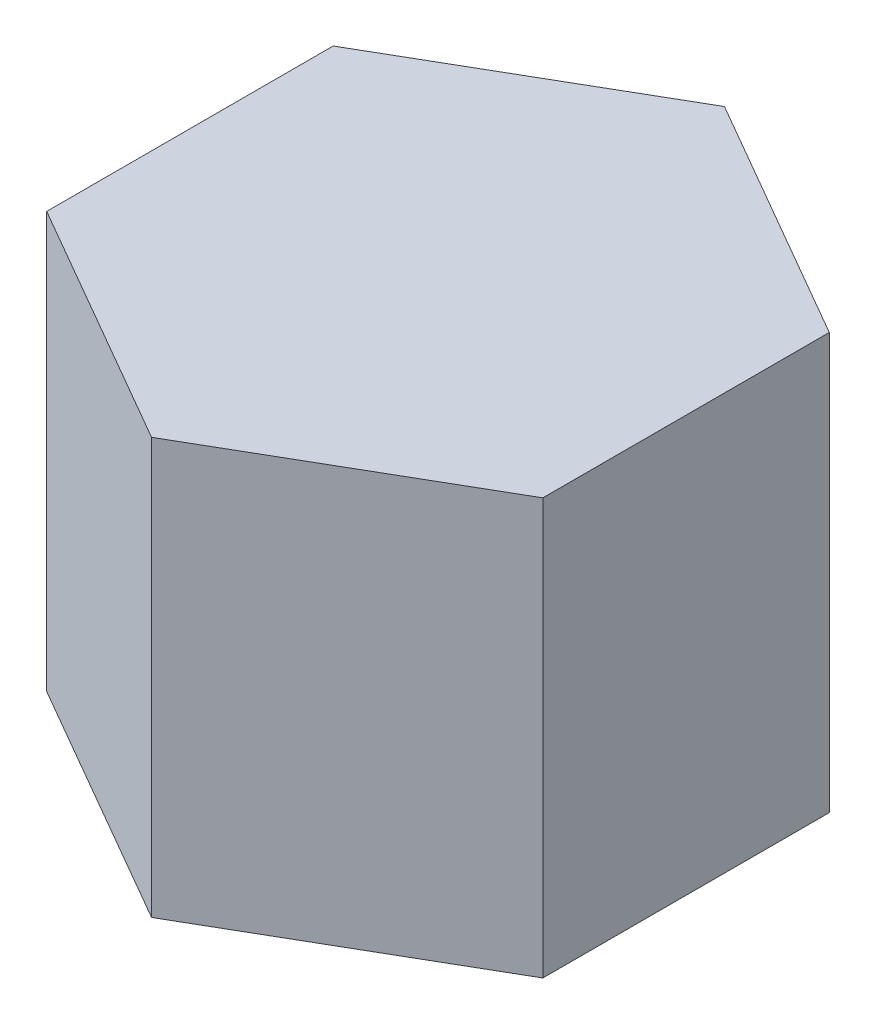
ISO-10303-21;
HEADER;
FILE_DESCRIPTION(('STEP AP214'),'2;1');
FILE_NAME('part.step','',(''),(''),'','','');
FILE_SCHEMA(('AUTOMOTIVE_DESIGN { 1 0 10303 214 1 1 1 1 }'));
ENDSEC;
DATA;
#1=APPLICATION_CONTEXT('core data for automotive mechanical design processes');
#2=APPLICATION_PROTOCOL_DEFINITION('international standard','automotive_design',2000,#1);
#3=PRODUCT_CONTEXT('',#1,'mechanical');
#4=PRODUCT('Part','Part','',(#3));
#5=PRODUCT_RELATED_PRODUCT_CATEGORY('part','',(#4));
#6=PRODUCT_DEFINITION_FORMATION('','',#4);
#7=PRODUCT_DEFINITION_CONTEXT('part definition',#1,'design');
#8=PRODUCT_DEFINITION('design','',#6,#7);
#9=PRODUCT_DEFINITION_SHAPE('','',#8);
#10=(LENGTH_UNIT() NAMED_UNIT(*) SI_UNIT(.MILLI.,.METRE.));
#11=(NAMED_UNIT(*) PLANE_ANGLE_UNIT() SI_UNIT($,.RADIAN.));
#12=(NAMED_UNIT(*) SI_UNIT($,.STERADIAN.) SOLID_ANGLE_UNIT());
#13=UNCERTAINTY_MEASURE_WITH_UNIT(LENGTH_MEASURE(1.E-05),#10,'distance_accuracy_value','');
#14=(GEOMETRIC_REPRESENTATION_CONTEXT(3) GLOBAL_UNCERTAINTY_ASSIGNED_CONTEXT((#13)) GLOBAL_UNIT_ASSIGNED_CONTEXT((#10,
#11,#12)) REPRESENTATION_CONTEXT('',''));
#15=CARTESIAN_POINT('',(0.,0.,0.));
#16=DIRECTION('',(0.,0.,1.));
#17=DIRECTION('',(1.,0.,0.));
#18=AXIS2_PLACEMENT_3D('',#15,#16,#17);
#19=CARTESIAN_POINT('',(204.142660308706,-148.537700895744,295.837098239417));
#20=DIRECTION('',(-0.499999999999943,0.,-0.866025403784472));
#21=DIRECTION('',(-0.866025403784472,0.,0.499999999999943));
#22=AXIS2_PLACEMENT_3D('',#19,#20,#21);
#23=PLANE('',#22);
#24=CARTESIAN_POINT('',(203.839551417381,-149.045793579175,296.012098239417));
#25=DIRECTION('',(0.866025403784471,0.,-0.499999999999943));
#26=VECTOR('',#25,1.);
#27=LINE('',#24,#26);
#28=CARTESIAN_POINT('',(203.839551417382,-149.045793579175,296.012098239417));
#29=VERTEX_POINT('',#28);
#30=CARTESIAN_POINT('',(204.142660308706,-149.045793579175,295.837098239417));
#31=VERTEX_POINT('',#30);
#32=EDGE_CURVE('E170',#29,#31,#27,.T.);
#33=ORIENTED_EDGE('',*,*,#32,.T.);
#34=CARTESIAN_POINT('',(204.142660308706,-148.537700895744,295.837098239417));
#35=DIRECTION('',(0.,-1.,0.));
#36=VECTOR('',#35,1.);
#37=LINE('',#34,#36);
#38=CARTESIAN_POINT('',(204.142660308706,-148.537700895744,295.837098239417));
#39=VERTEX_POINT('',#38);
#40=EDGE_CURVE('E35',#39,#31,#37,.T.);
#41=ORIENTED_EDGE('',*,*,#40,.F.);
#42=CARTESIAN_POINT('',(203.839551417381,-148.537700895744,296.012098239417));
#43=DIRECTION('',(0.866025403784471,0.,-0.499999999999943));
#44=VECTOR('',#43,1.);
#45=LINE('',#42,#44);
#46=CARTESIAN_POINT('',(203.839551417382,-148.537700895744,296.012098239417));
#47=VERTEX_POINT('',#46);
#48=EDGE_CURVE('E159',#47,#39,#45,.T.);
#49=ORIENTED_EDGE('',*,*,#48,.F.);
#50=CARTESIAN_POINT('',(203.839551417381,-148.537700895744,296.012098239417));
#51=DIRECTION('',(0.,-1.,0.));
#52=VECTOR('',#51,1.);
#53=LINE('',#50,#52);
#54=EDGE_CURVE('E10',#47,#29,#53,.T.);
#55=ORIENTED_EDGE('',*,*,#54,.T.);
#56=EDGE_LOOP('',(#33,#41,#49,#55));
#57=FACE_BOUND('',#56,.T.);
#58=ADVANCED_FACE('F16',(#57),#23,.F.);
#59=CARTESIAN_POINT('',(203.839551417382,-148.537700895744,296.012098239417));
#60=DIRECTION('',(0.499999999999978,0.,-0.866025403784452));
#61=DIRECTION('',(-0.866025403784452,0.,-0.499999999999978));
#62=AXIS2_PLACEMENT_3D('',#59,#60,#61);
#63=PLANE('',#62);
#64=CARTESIAN_POINT('',(203.536442526057,-149.045793579175,295.837098239417));
#65=DIRECTION('',(0.866025403784452,0.,0.499999999999978));
#66=VECTOR('',#65,1.);
#67=LINE('',#64,#66);
#68=CARTESIAN_POINT('',(203.536442526057,-149.045793579175,295.837098239417));
#69=VERTEX_POINT('',#68);
#70=EDGE_CURVE('E167',#69,#29,#67,.T.);
#71=ORIENTED_EDGE('',*,*,#70,.T.);
#72=ORIENTED_EDGE('',*,*,#54,.F.);
#73=CARTESIAN_POINT('',(203.536442526057,-148.537700895744,295.837098239417));
#74=DIRECTION('',(0.866025403784452,0.,0.499999999999978));
#75=VECTOR('',#74,1.);
#76=LINE('',#73,#75);
#77=CARTESIAN_POINT('',(203.536442526057,-148.537700895744,295.837098239417));
#78=VERTEX_POINT('',#77);
#79=EDGE_CURVE('E156',#78,#47,#76,.T.);
#80=ORIENTED_EDGE('',*,*,#79,.F.);
#81=CARTESIAN_POINT('',(203.536442526057,-148.537700895744,295.837098239417));
#82=DIRECTION('',(0.,-1.,0.));
#83=VECTOR('',#82,1.);
#84=LINE('',#81,#83);
#85=EDGE_CURVE('E27',#78,#69,#84,.T.);
#86=ORIENTED_EDGE('',*,*,#85,.T.);
#87=EDGE_LOOP('',(#71,#72,#80,#86));
#88=FACE_BOUND('',#87,.T.);
#89=ADVANCED_FACE('F189',(#88),#63,.F.);
#90=CARTESIAN_POINT('',(203.536442526057,-148.537700895744,290.831971220494));
#91=DIRECTION('',(1.,0.,0.));
#92=DIRECTION('',(0.,1.,0.));
#93=AXIS2_PLACEMENT_3D('',#90,#91,#92);
#94=PLANE('',#93);
#95=CARTESIAN_POINT('',(203.536442526057,-149.045793579175,295.487098239417));
#96=DIRECTION('',(0.,0.,1.));
#97=VECTOR('',#96,1.);
#98=LINE('',#95,#97);
#99=CARTESIAN_POINT('',(203.536442526057,-149.045793579175,295.487098239417));
#100=VERTEX_POINT('',#99);
#101=EDGE_CURVE('E163',#100,#69,#98,.T.);
#102=ORIENTED_EDGE('',*,*,#101,.T.);
#103=ORIENTED_EDGE('',*,*,#85,.F.);
#104=CARTESIAN_POINT('',(203.536442526057,-148.537700895744,295.487098239417));
#105=DIRECTION('',(0.,0.,1.));
#106=VECTOR('',#105,1.);
#107=LINE('',#104,#106);
#108=CARTESIAN_POINT('',(203.536442526057,-148.537700895744,295.487098239417));
#109=VERTEX_POINT('',#108);
#110=EDGE_CURVE('E106',#109,#78,#107,.T.);
#111=ORIENTED_EDGE('',*,*,#110,.F.);
#112=CARTESIAN_POINT('',(203.536442526057,-148.537700895744,295.487098239417));
#113=DIRECTION('',(0.,-1.,0.));
#114=VECTOR('',#113,1.);
#115=LINE('',#112,#114);
#116=EDGE_CURVE('E94',#109,#100,#115,.T.);
#117=ORIENTED_EDGE('',*,*,#116,.T.);
#118=EDGE_LOOP('',(#102,#103,#111,#117));
#119=FACE_BOUND('',#118,.T.);
#120=ADVANCED_FACE('F198',(#119),#94,.F.);
#121=CARTESIAN_POINT('',(203.536442526057,-148.537700895744,295.487098239417));
#122=DIRECTION('',(0.499999999999978,0.,0.866025403784452));
#123=DIRECTION('',(0.866025403784452,0.,-0.499999999999978));
#124=AXIS2_PLACEMENT_3D('',#121,#122,#123);
#125=PLANE('',#124);
#126=CARTESIAN_POINT('',(203.839551417382,-149.045793579175,295.312098239417));
#127=DIRECTION('',(-0.866025403784452,0.,0.499999999999978));
#128=VECTOR('',#127,1.);
#129=LINE('',#126,#128);
#130=CARTESIAN_POINT('',(203.839551417382,-149.045793579175,295.312098239417));
#131=VERTEX_POINT('',#130);
#132=EDGE_CURVE('E162',#131,#100,#129,.T.);
#133=ORIENTED_EDGE('',*,*,#132,.T.);
#134=ORIENTED_EDGE('',*,*,#116,.F.);
#135=CARTESIAN_POINT('',(203.839551417382,-148.537700895744,295.312098239417));
#136=DIRECTION('',(-0.866025403784452,0.,0.499999999999978));
#137=VECTOR('',#136,1.);
#138=LINE('',#135,#137);
#139=CARTESIAN_POINT('',(203.839551417382,-148.537700895744,295.312098239417));
#140=VERTEX_POINT('',#139);
#141=EDGE_CURVE('E98',#140,#109,#138,.T.);
#142=ORIENTED_EDGE('',*,*,#141,.F.);
#143=CARTESIAN_POINT('',(203.839551417382,-148.537700895744,295.312098239417));
#144=DIRECTION('',(0.,-1.,0.));
#145=VECTOR('',#144,1.);
#146=LINE('',#143,#145);
#147=EDGE_CURVE('E79',#140,#131,#146,.T.);
#148=ORIENTED_EDGE('',*,*,#147,.T.);
#149=EDGE_LOOP('',(#133,#134,#142,#148));
#150=FACE_BOUND('',#149,.T.);
#151=ADVANCED_FACE('F100',(#150),#125,.F.);
#152=CARTESIAN_POINT('',(203.839551417382,-148.537700895744,295.312098239417));
#153=DIRECTION('',(-0.500000000000096,0.,0.866025403784383));
#154=DIRECTION('',(0.866025403784383,0.,0.500000000000096));
#155=AXIS2_PLACEMENT_3D('',#152,#153,#154);
#156=PLANE('',#155);
#157=CARTESIAN_POINT('',(204.142660308706,-149.045793579175,295.487098239417));
#158=DIRECTION('',(-0.866025403784383,0.,-0.500000000000096));
#159=VECTOR('',#158,1.);
#160=LINE('',#157,#159);
#161=CARTESIAN_POINT('',(204.142660308706,-149.045793579175,295.487098239417));
#162=VERTEX_POINT('',#161);
#163=EDGE_CURVE('E88',#162,#131,#160,.T.);
#164=ORIENTED_EDGE('',*,*,#163,.T.);
#165=ORIENTED_EDGE('',*,*,#147,.F.);
#166=CARTESIAN_POINT('',(204.142660308706,-148.537700895744,295.487098239417));
#167=DIRECTION('',(-0.866025403784383,0.,-0.500000000000096));
#168=VECTOR('',#167,1.);
#169=LINE('',#166,#168);
#170=CARTESIAN_POINT('',(204.142660308706,-148.537700895744,295.487098239417));
#171=VERTEX_POINT('',#170);
#172=EDGE_CURVE('E84',#171,#140,#169,.T.);
#173=ORIENTED_EDGE('',*,*,#172,.F.);
#174=CARTESIAN_POINT('',(204.142660308706,-148.537700895744,295.487098239417));
#175=DIRECTION('',(0.,-1.,0.));
#176=VECTOR('',#175,1.);
#177=LINE('',#174,#176);
#178=EDGE_CURVE('E58',#171,#162,#177,.T.);
#179=ORIENTED_EDGE('',*,*,#178,.T.);
#180=EDGE_LOOP('',(#164,#165,#173,#179));
#181=FACE_BOUND('',#180,.T.);
#182=ADVANCED_FACE('F82',(#181),#156,.F.);
#183=CARTESIAN_POINT('',(204.142660308706,-148.537700895744,290.831971220494));
#184=DIRECTION('',(-1.,0.,0.));
#185=DIRECTION('',(0.,-1.,0.));
#186=AXIS2_PLACEMENT_3D('',#183,#184,#185);
#187=PLANE('',#186);
#188=CARTESIAN_POINT('',(204.142660308706,-149.045793579175,295.837098239417));
#189=DIRECTION('',(0.,0.,-1.));
#190=VECTOR('',#189,1.);
#191=LINE('',#188,#190);
#192=EDGE_CURVE('E160',#31,#162,#191,.T.);
#193=ORIENTED_EDGE('',*,*,#192,.T.);
#194=ORIENTED_EDGE('',*,*,#178,.F.);
#195=CARTESIAN_POINT('',(204.142660308706,-148.537700895744,295.837098239417));
#196=DIRECTION('',(0.,0.,-1.));
#197=VECTOR('',#196,1.);
#198=LINE('',#195,#197);
#199=EDGE_CURVE('E112',#39,#171,#198,.T.);
#200=ORIENTED_EDGE('',*,*,#199,.F.);
#201=ORIENTED_EDGE('',*,*,#40,.T.);
#202=EDGE_LOOP('',(#193,#194,#200,#201));
#203=FACE_BOUND('',#202,.T.);
#204=ADVANCED_FACE('F131',(#203),#187,.F.);
#205=CARTESIAN_POINT('',(206.339551417382,-148.537700895744,290.831971220494));
#206=DIRECTION('',(0.,-1.,0.));
#207=DIRECTION('',(1.,0.,0.));
#208=AXIS2_PLACEMENT_3D('',#205,#206,#207);
#209=PLANE('',#208);
#210=ORIENTED_EDGE('',*,*,#48,.T.);
#211=ORIENTED_EDGE('',*,*,#199,.T.);
#212=ORIENTED_EDGE('',*,*,#172,.T.);
#213=ORIENTED_EDGE('',*,*,#141,.T.);
#214=ORIENTED_EDGE('',*,*,#110,.T.);
#215=ORIENTED_EDGE('',*,*,#79,.T.);
#216=EDGE_LOOP('',(#210,#211,#212,#213,#214,#215));
#217=FACE_BOUND('',#216,.T.);
#218=ADVANCED_FACE('F111',(#217),#209,.F.);
#219=CARTESIAN_POINT('',(206.339551417382,-149.045793579175,290.831971220494));
#220=DIRECTION('',(0.,-1.,0.));
#221=DIRECTION('',(1.,0.,0.));
#222=AXIS2_PLACEMENT_3D('',#219,#220,#221);
#223=PLANE('',#222);
#224=ORIENTED_EDGE('',*,*,#32,.F.);
#225=ORIENTED_EDGE('',*,*,#70,.F.);
#226=ORIENTED_EDGE('',*,*,#101,.F.);
#227=ORIENTED_EDGE('',*,*,#132,.F.);
#228=ORIENTED_EDGE('',*,*,#163,.F.);
#229=ORIENTED_EDGE('',*,*,#192,.F.);
#230=EDGE_LOOP('',(#224,#225,#226,#227,#228,#229));
#231=FACE_BOUND('',#230,.T.);
#232=ADVANCED_FACE('F130',(#231),#223,.T.);
#233=CLOSED_SHELL('',(#58,#89,#120,#151,#182,#204,#218,#232));
#234=MANIFOLD_SOLID_BREP('B1',#233);
#235=ADVANCED_BREP_SHAPE_REPRESENTATION('',(#18,#234),#14);
#236=SHAPE_DEFINITION_REPRESENTATION(#9,#235);
ENDSEC;
END-ISO-10303-21;
